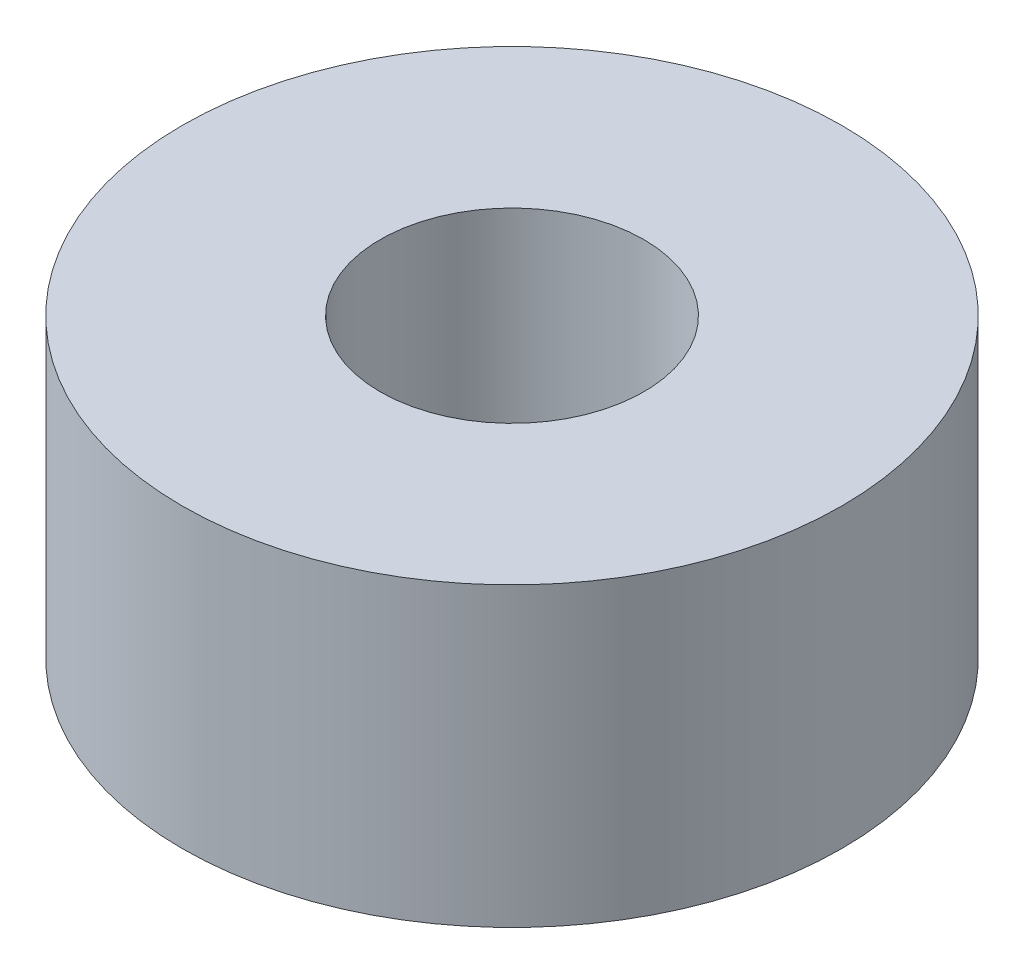
ISO-10303-21;
HEADER;
FILE_DESCRIPTION(('STEP AP214'),'2;1');
FILE_NAME('part.step','',(''),(''),'','','');
FILE_SCHEMA(('AUTOMOTIVE_DESIGN { 1 0 10303 214 1 1 1 1 }'));
ENDSEC;
DATA;
#1=APPLICATION_CONTEXT('core data for automotive mechanical design processes');
#2=APPLICATION_PROTOCOL_DEFINITION('international standard','automotive_design',2000,#1);
#3=PRODUCT_CONTEXT('',#1,'mechanical');
#4=PRODUCT('Part','Part','',(#3));
#5=PRODUCT_RELATED_PRODUCT_CATEGORY('part','',(#4));
#6=PRODUCT_DEFINITION_FORMATION('','',#4);
#7=PRODUCT_DEFINITION_CONTEXT('part definition',#1,'design');
#8=PRODUCT_DEFINITION('design','',#6,#7);
#9=PRODUCT_DEFINITION_SHAPE('','',#8);
#10=(LENGTH_UNIT() NAMED_UNIT(*) SI_UNIT(.MILLI.,.METRE.));
#11=(NAMED_UNIT(*) PLANE_ANGLE_UNIT() SI_UNIT($,.RADIAN.));
#12=(NAMED_UNIT(*) SI_UNIT($,.STERADIAN.) SOLID_ANGLE_UNIT());
#13=UNCERTAINTY_MEASURE_WITH_UNIT(LENGTH_MEASURE(1.E-05),#10,'distance_accuracy_value','');
#14=(GEOMETRIC_REPRESENTATION_CONTEXT(3) GLOBAL_UNCERTAINTY_ASSIGNED_CONTEXT((#13)) GLOBAL_UNIT_ASSIGNED_CONTEXT((#10,
#11,#12)) REPRESENTATION_CONTEXT('',''));
#15=CARTESIAN_POINT('',(0.,0.,0.));
#16=DIRECTION('',(0.,0.,1.));
#17=DIRECTION('',(1.,0.,0.));
#18=AXIS2_PLACEMENT_3D('',#15,#16,#17);
#19=CARTESIAN_POINT('',(0.,4.5,0.));
#20=DIRECTION('',(0.,1.,0.));
#21=DIRECTION('',(0.,0.,1.));
#22=AXIS2_PLACEMENT_3D('',#19,#20,#21);
#23=PLANE('',#22);
#24=CARTESIAN_POINT('',(0.,4.5,0.));
#25=DIRECTION('',(0.,1.,0.));
#26=DIRECTION('',(0.,0.,1.));
#27=AXIS2_PLACEMENT_3D('',#24,#25,#26);
#28=CIRCLE('',#27,5.);
#29=CARTESIAN_POINT('',(0.,4.5,5.));
#30=VERTEX_POINT('',#29);
#31=EDGE_CURVE('E10',#30,#30,#28,.T.);
#32=ORIENTED_EDGE('',*,*,#31,.T.);
#33=EDGE_LOOP('',(#32));
#34=FACE_BOUND('',#33,.T.);
#35=CARTESIAN_POINT('',(0.,4.5,0.));
#36=DIRECTION('',(0.,1.,0.));
#37=DIRECTION('',(0.,0.,1.));
#38=AXIS2_PLACEMENT_3D('',#35,#36,#37);
#39=CIRCLE('',#38,2.);
#40=CARTESIAN_POINT('',(0.,4.5,2.));
#41=VERTEX_POINT('',#40);
#42=EDGE_CURVE('E46',#41,#41,#39,.T.);
#43=ORIENTED_EDGE('',*,*,#42,.F.);
#44=EDGE_LOOP('',(#43));
#45=FACE_BOUND('',#44,.T.);
#46=ADVANCED_FACE('F35',(#34,#45),#23,.T.);
#47=CARTESIAN_POINT('',(0.,0.,0.));
#48=DIRECTION('',(0.,1.,0.));
#49=DIRECTION('',(0.,0.,1.));
#50=AXIS2_PLACEMENT_3D('',#47,#48,#49);
#51=PLANE('',#50);
#52=CARTESIAN_POINT('',(0.,0.,0.));
#53=DIRECTION('',(0.,1.,0.));
#54=DIRECTION('',(0.,0.,1.));
#55=AXIS2_PLACEMENT_3D('',#52,#53,#54);
#56=CIRCLE('',#55,5.);
#57=CARTESIAN_POINT('',(0.,0.,5.));
#58=VERTEX_POINT('',#57);
#59=EDGE_CURVE('E39',#58,#58,#56,.T.);
#60=ORIENTED_EDGE('',*,*,#59,.F.);
#61=EDGE_LOOP('',(#60));
#62=FACE_BOUND('',#61,.T.);
#63=CARTESIAN_POINT('',(0.,0.,0.));
#64=DIRECTION('',(0.,1.,0.));
#65=DIRECTION('',(0.,0.,1.));
#66=AXIS2_PLACEMENT_3D('',#63,#64,#65);
#67=CIRCLE('',#66,2.);
#68=CARTESIAN_POINT('',(0.,0.,2.));
#69=VERTEX_POINT('',#68);
#70=EDGE_CURVE('E48',#69,#69,#67,.T.);
#71=ORIENTED_EDGE('',*,*,#70,.T.);
#72=EDGE_LOOP('',(#71));
#73=FACE_BOUND('',#72,.T.);
#74=ADVANCED_FACE('F58',(#62,#73),#51,.F.);
#75=CARTESIAN_POINT('',(0.,4.5,0.));
#76=DIRECTION('',(0.,-1.,0.));
#77=DIRECTION('',(0.,0.,-1.));
#78=AXIS2_PLACEMENT_3D('',#75,#76,#77);
#79=CYLINDRICAL_SURFACE('',#78,5.);
#80=ORIENTED_EDGE('',*,*,#31,.F.);
#81=EDGE_LOOP('',(#80));
#82=FACE_BOUND('',#81,.T.);
#83=ORIENTED_EDGE('',*,*,#59,.T.);
#84=EDGE_LOOP('',(#83));
#85=FACE_BOUND('',#84,.T.);
#86=ADVANCED_FACE('F37',(#82,#85),#79,.T.);
#87=CARTESIAN_POINT('',(0.,4.5,0.));
#88=DIRECTION('',(0.,-1.,0.));
#89=DIRECTION('',(0.,0.,-1.));
#90=AXIS2_PLACEMENT_3D('',#87,#88,#89);
#91=CYLINDRICAL_SURFACE('',#90,2.);
#92=ORIENTED_EDGE('',*,*,#42,.T.);
#93=EDGE_LOOP('',(#92));
#94=FACE_BOUND('',#93,.T.);
#95=ORIENTED_EDGE('',*,*,#70,.F.);
#96=EDGE_LOOP('',(#95));
#97=FACE_BOUND('',#96,.T.);
#98=ADVANCED_FACE('F54',(#94,#97),#91,.F.);
#99=CLOSED_SHELL('',(#46,#74,#86,#98));
#100=MANIFOLD_SOLID_BREP('B2',#99);
#101=ADVANCED_BREP_SHAPE_REPRESENTATION('',(#18,#100),#14);
#102=SHAPE_DEFINITION_REPRESENTATION(#9,#101);
ENDSEC;
END-ISO-10303-21;
